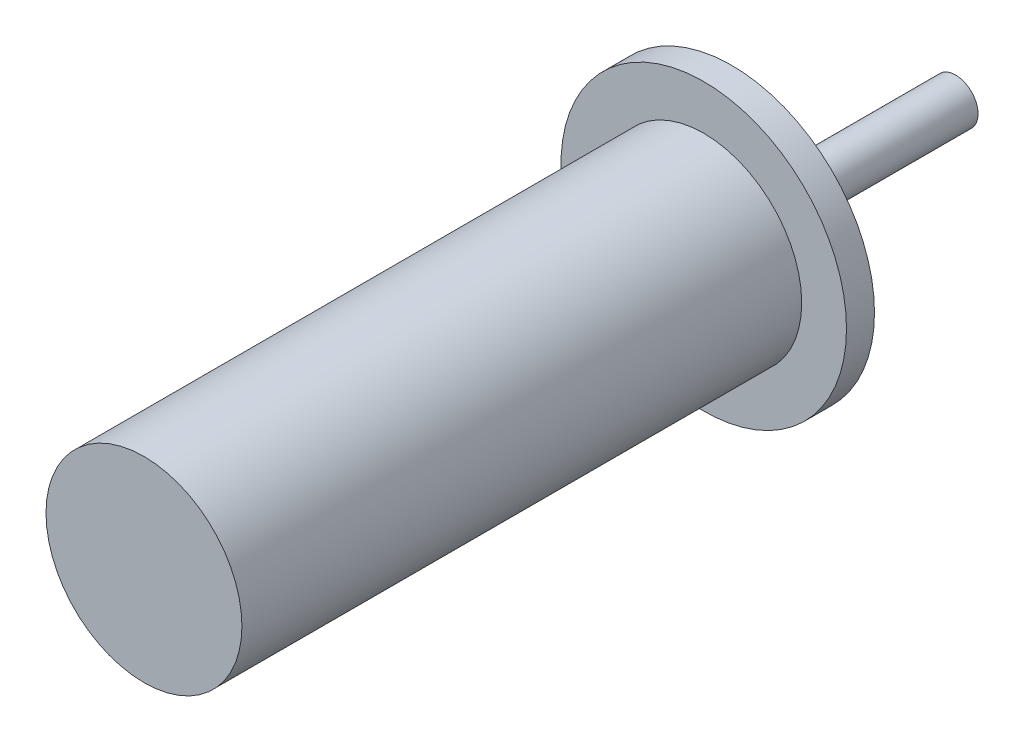
ISO-10303-21;
HEADER;
FILE_DESCRIPTION(('STEP AP214'),'2;1');
FILE_NAME('part.step','',(''),(''),'','','');
FILE_SCHEMA(('AUTOMOTIVE_DESIGN { 1 0 10303 214 1 1 1 1 }'));
ENDSEC;
DATA;
#1=APPLICATION_CONTEXT('core data for automotive mechanical design processes');
#2=APPLICATION_PROTOCOL_DEFINITION('international standard','automotive_design',2000,#1);
#3=PRODUCT_CONTEXT('',#1,'mechanical');
#4=PRODUCT('Part','Part','',(#3));
#5=PRODUCT_RELATED_PRODUCT_CATEGORY('part','',(#4));
#6=PRODUCT_DEFINITION_FORMATION('','',#4);
#7=PRODUCT_DEFINITION_CONTEXT('part definition',#1,'design');
#8=PRODUCT_DEFINITION('design','',#6,#7);
#9=PRODUCT_DEFINITION_SHAPE('','',#8);
#10=(LENGTH_UNIT() NAMED_UNIT(*) SI_UNIT(.MILLI.,.METRE.));
#11=(NAMED_UNIT(*) PLANE_ANGLE_UNIT() SI_UNIT($,.RADIAN.));
#12=(NAMED_UNIT(*) SI_UNIT($,.STERADIAN.) SOLID_ANGLE_UNIT());
#13=UNCERTAINTY_MEASURE_WITH_UNIT(LENGTH_MEASURE(1.E-05),#10,'distance_accuracy_value','');
#14=(GEOMETRIC_REPRESENTATION_CONTEXT(3) GLOBAL_UNCERTAINTY_ASSIGNED_CONTEXT((#13)) GLOBAL_UNIT_ASSIGNED_CONTEXT((#10,
#11,#12)) REPRESENTATION_CONTEXT('',''));
#15=CARTESIAN_POINT('',(0.,0.,0.));
#16=DIRECTION('',(0.,0.,1.));
#17=DIRECTION('',(1.,0.,0.));
#18=AXIS2_PLACEMENT_3D('',#15,#16,#17);
#19=CARTESIAN_POINT('',(0.,0.,5.));
#20=DIRECTION('',(0.,0.,-1.));
#21=DIRECTION('',(-1.,0.,0.));
#22=AXIS2_PLACEMENT_3D('',#19,#20,#21);
#23=CYLINDRICAL_SURFACE('',#22,25.5);
#24=CARTESIAN_POINT('',(0.,0.,5.));
#25=DIRECTION('',(0.,0.,1.));
#26=DIRECTION('',(1.,0.,0.));
#27=AXIS2_PLACEMENT_3D('',#24,#25,#26);
#28=CIRCLE('',#27,25.5);
#29=CARTESIAN_POINT('',(25.5,0.,5.));
#30=VERTEX_POINT('',#29);
#31=EDGE_CURVE('E51',#30,#30,#28,.T.);
#32=ORIENTED_EDGE('',*,*,#31,.F.);
#33=EDGE_LOOP('',(#32));
#34=FACE_BOUND('',#33,.T.);
#35=CARTESIAN_POINT('',(0.,0.,0.));
#36=DIRECTION('',(0.,0.,1.));
#37=DIRECTION('',(1.,0.,0.));
#38=AXIS2_PLACEMENT_3D('',#35,#36,#37);
#39=CIRCLE('',#38,25.5);
#40=CARTESIAN_POINT('',(25.5,0.,0.));
#41=VERTEX_POINT('',#40);
#42=EDGE_CURVE('E40',#41,#41,#39,.T.);
#43=ORIENTED_EDGE('',*,*,#42,.T.);
#44=EDGE_LOOP('',(#43));
#45=FACE_BOUND('',#44,.T.);
#46=ADVANCED_FACE('F37',(#34,#45),#23,.T.);
#47=CARTESIAN_POINT('',(0.,0.,5.));
#48=DIRECTION('',(0.,0.,1.));
#49=DIRECTION('',(1.,0.,0.));
#50=AXIS2_PLACEMENT_3D('',#47,#48,#49);
#51=PLANE('',#50);
#52=CARTESIAN_POINT('',(0.,0.,5.));
#53=DIRECTION('',(0.,0.,1.));
#54=DIRECTION('',(1.,0.,0.));
#55=AXIS2_PLACEMENT_3D('',#52,#53,#54);
#56=CIRCLE('',#55,17.5);
#57=CARTESIAN_POINT('',(17.5,0.,5.));
#58=VERTEX_POINT('',#57);
#59=EDGE_CURVE('E45',#58,#58,#56,.T.);
#60=ORIENTED_EDGE('',*,*,#59,.F.);
#61=EDGE_LOOP('',(#60));
#62=FACE_BOUND('',#61,.T.);
#63=ORIENTED_EDGE('',*,*,#31,.T.);
#64=EDGE_LOOP('',(#63));
#65=FACE_BOUND('',#64,.T.);
#66=ADVANCED_FACE('F71',(#62,#65),#51,.T.);
#67=CARTESIAN_POINT('',(0.,0.,0.));
#68=DIRECTION('',(0.,0.,1.));
#69=DIRECTION('',(1.,0.,0.));
#70=AXIS2_PLACEMENT_3D('',#67,#68,#69);
#71=PLANE('',#70);
#72=CARTESIAN_POINT('',(0.,0.,0.));
#73=DIRECTION('',(0.,0.,-1.));
#74=DIRECTION('',(-1.,0.,0.));
#75=AXIS2_PLACEMENT_3D('',#72,#73,#74);
#76=CIRCLE('',#75,4.);
#77=CARTESIAN_POINT('',(-4.,0.,0.));
#78=VERTEX_POINT('',#77);
#79=EDGE_CURVE('E10',#78,#78,#76,.T.);
#80=ORIENTED_EDGE('',*,*,#79,.F.);
#81=EDGE_LOOP('',(#80));
#82=FACE_BOUND('',#81,.T.);
#83=ORIENTED_EDGE('',*,*,#42,.F.);
#84=EDGE_LOOP('',(#83));
#85=FACE_BOUND('',#84,.T.);
#86=ADVANCED_FACE('F68',(#82,#85),#71,.F.);
#87=CARTESIAN_POINT('',(0.,0.,105.));
#88=DIRECTION('',(0.,0.,-1.));
#89=DIRECTION('',(-1.,0.,0.));
#90=AXIS2_PLACEMENT_3D('',#87,#88,#89);
#91=CYLINDRICAL_SURFACE('',#90,17.5);
#92=CARTESIAN_POINT('',(0.,0.,105.));
#93=DIRECTION('',(0.,0.,1.));
#94=DIRECTION('',(1.,0.,0.));
#95=AXIS2_PLACEMENT_3D('',#92,#93,#94);
#96=CIRCLE('',#95,17.5);
#97=CARTESIAN_POINT('',(17.5,0.,105.));
#98=VERTEX_POINT('',#97);
#99=EDGE_CURVE('E56',#98,#98,#96,.T.);
#100=ORIENTED_EDGE('',*,*,#99,.F.);
#101=EDGE_LOOP('',(#100));
#102=FACE_BOUND('',#101,.T.);
#103=ORIENTED_EDGE('',*,*,#59,.T.);
#104=EDGE_LOOP('',(#103));
#105=FACE_BOUND('',#104,.T.);
#106=ADVANCED_FACE('F70',(#102,#105),#91,.T.);
#107=CARTESIAN_POINT('',(0.,0.,105.));
#108=DIRECTION('',(0.,0.,1.));
#109=DIRECTION('',(1.,0.,0.));
#110=AXIS2_PLACEMENT_3D('',#107,#108,#109);
#111=PLANE('',#110);
#112=ORIENTED_EDGE('',*,*,#99,.T.);
#113=EDGE_LOOP('',(#112));
#114=FACE_BOUND('',#113,.T.);
#115=ADVANCED_FACE('F77',(#114),#111,.T.);
#116=CARTESIAN_POINT('',(0.,0.,-40.));
#117=DIRECTION('',(0.,0.,1.));
#118=DIRECTION('',(1.,0.,0.));
#119=AXIS2_PLACEMENT_3D('',#116,#117,#118);
#120=CYLINDRICAL_SURFACE('',#119,4.);
#121=CARTESIAN_POINT('',(0.,0.,-40.));
#122=DIRECTION('',(0.,0.,-1.));
#123=DIRECTION('',(-1.,0.,0.));
#124=AXIS2_PLACEMENT_3D('',#121,#122,#123);
#125=CIRCLE('',#124,4.);
#126=CARTESIAN_POINT('',(-4.,0.,-40.));
#127=VERTEX_POINT('',#126);
#128=EDGE_CURVE('E55',#127,#127,#125,.T.);
#129=ORIENTED_EDGE('',*,*,#128,.F.);
#130=EDGE_LOOP('',(#129));
#131=FACE_BOUND('',#130,.T.);
#132=ORIENTED_EDGE('',*,*,#79,.T.);
#133=EDGE_LOOP('',(#132));
#134=FACE_BOUND('',#133,.T.);
#135=ADVANCED_FACE('F105',(#131,#134),#120,.T.);
#136=CARTESIAN_POINT('',(0.,0.,-40.));
#137=DIRECTION('',(0.,0.,-1.));
#138=DIRECTION('',(-1.,0.,0.));
#139=AXIS2_PLACEMENT_3D('',#136,#137,#138);
#140=PLANE('',#139);
#141=ORIENTED_EDGE('',*,*,#128,.T.);
#142=EDGE_LOOP('',(#141));
#143=FACE_BOUND('',#142,.T.);
#144=ADVANCED_FACE('F119',(#143),#140,.T.);
#145=CLOSED_SHELL('',(#46,#66,#86,#106,#115,#135,#144));
#146=MANIFOLD_SOLID_BREP('B2',#145);
#147=ADVANCED_BREP_SHAPE_REPRESENTATION('',(#18,#146),#14);
#148=SHAPE_DEFINITION_REPRESENTATION(#9,#147);
ENDSEC;
END-ISO-10303-21;
